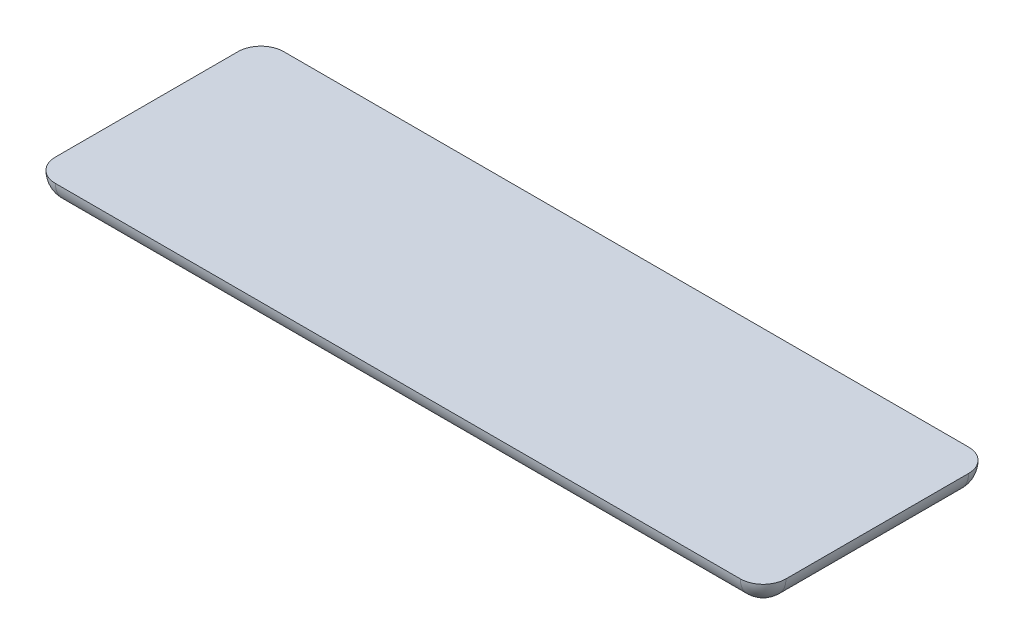
ISO-10303-21;
HEADER;
FILE_DESCRIPTION(('STEP AP214'),'2;1');
FILE_NAME('part.step','',(''),(''),'','','');
FILE_SCHEMA(('AUTOMOTIVE_DESIGN { 1 0 10303 214 1 1 1 1 }'));
ENDSEC;
DATA;
#1=APPLICATION_CONTEXT('core data for automotive mechanical design processes');
#2=APPLICATION_PROTOCOL_DEFINITION('international standard','automotive_design',2000,#1);
#3=PRODUCT_CONTEXT('',#1,'mechanical');
#4=PRODUCT('Part','Part','',(#3));
#5=PRODUCT_RELATED_PRODUCT_CATEGORY('part','',(#4));
#6=PRODUCT_DEFINITION_FORMATION('','',#4);
#7=PRODUCT_DEFINITION_CONTEXT('part definition',#1,'design');
#8=PRODUCT_DEFINITION('design','',#6,#7);
#9=PRODUCT_DEFINITION_SHAPE('','',#8);
#10=(LENGTH_UNIT() NAMED_UNIT(*) SI_UNIT(.MILLI.,.METRE.));
#11=(NAMED_UNIT(*) PLANE_ANGLE_UNIT() SI_UNIT($,.RADIAN.));
#12=(NAMED_UNIT(*) SI_UNIT($,.STERADIAN.) SOLID_ANGLE_UNIT());
#13=UNCERTAINTY_MEASURE_WITH_UNIT(LENGTH_MEASURE(1.E-05),#10,'distance_accuracy_value','');
#14=(GEOMETRIC_REPRESENTATION_CONTEXT(3) GLOBAL_UNCERTAINTY_ASSIGNED_CONTEXT((#13)) GLOBAL_UNIT_ASSIGNED_CONTEXT((#10,
#11,#12)) REPRESENTATION_CONTEXT('',''));
#15=CARTESIAN_POINT('',(0.,0.,0.));
#16=DIRECTION('',(0.,0.,1.));
#17=DIRECTION('',(1.,0.,0.));
#18=AXIS2_PLACEMENT_3D('',#15,#16,#17);
#19=CARTESIAN_POINT('',(0.,-20.,0.));
#20=DIRECTION('',(0.,-1.,0.));
#21=DIRECTION('',(0.,0.,-1.));
#22=AXIS2_PLACEMENT_3D('',#19,#20,#21);
#23=PLANE('',#22);
#24=CARTESIAN_POINT('',(75.,-20.,20.));
#25=DIRECTION('',(0.,-1.,0.));
#26=DIRECTION('',(0.,0.,-1.));
#27=AXIS2_PLACEMENT_3D('',#24,#25,#26);
#28=CIRCLE('',#27,5.);
#29=CARTESIAN_POINT('',(80.,-20.,20.));
#30=VERTEX_POINT('',#29);
#31=CARTESIAN_POINT('',(75.,-20.,25.));
#32=VERTEX_POINT('',#31);
#33=EDGE_CURVE('E353',#30,#32,#28,.T.);
#34=ORIENTED_EDGE('',*,*,#33,.F.);
#35=DIRECTION('',(0.,0.,-1.));
#36=VECTOR('',#35,1.);
#37=CARTESIAN_POINT('',(80.,-20.,25.));
#38=LINE('',#37,#36);
#39=CARTESIAN_POINT('',(80.,-20.,-20.));
#40=VERTEX_POINT('',#39);
#41=EDGE_CURVE('E11',#30,#40,#38,.T.);
#42=ORIENTED_EDGE('',*,*,#41,.T.);
#43=CARTESIAN_POINT('',(75.,-20.,-20.));
#44=DIRECTION('',(0.,-1.,0.));
#45=DIRECTION('',(0.,0.,-1.));
#46=AXIS2_PLACEMENT_3D('',#43,#44,#45);
#47=CIRCLE('',#46,5.);
#48=CARTESIAN_POINT('',(75.,-20.,-25.));
#49=VERTEX_POINT('',#48);
#50=EDGE_CURVE('E351',#49,#40,#47,.T.);
#51=ORIENTED_EDGE('',*,*,#50,.F.);
#52=DIRECTION('',(-1.,0.,0.));
#53=VECTOR('',#52,1.);
#54=CARTESIAN_POINT('',(80.,-20.,-25.));
#55=LINE('',#54,#53);
#56=CARTESIAN_POINT('',(-75.,-20.,-25.));
#57=VERTEX_POINT('',#56);
#58=EDGE_CURVE('E339',#49,#57,#55,.T.);
#59=ORIENTED_EDGE('',*,*,#58,.T.);
#60=CARTESIAN_POINT('',(-75.,-20.,-20.));
#61=DIRECTION('',(0.,-1.,0.));
#62=DIRECTION('',(0.,0.,-1.));
#63=AXIS2_PLACEMENT_3D('',#60,#61,#62);
#64=CIRCLE('',#63,5.);
#65=CARTESIAN_POINT('',(-80.,-20.,-20.));
#66=VERTEX_POINT('',#65);
#67=EDGE_CURVE('E366',#66,#57,#64,.T.);
#68=ORIENTED_EDGE('',*,*,#67,.F.);
#69=DIRECTION('',(0.,0.,1.));
#70=VECTOR('',#69,1.);
#71=CARTESIAN_POINT('',(-80.,-20.,25.));
#72=LINE('',#71,#70);
#73=CARTESIAN_POINT('',(-80.,-20.,20.));
#74=VERTEX_POINT('',#73);
#75=EDGE_CURVE('E44',#66,#74,#72,.T.);
#76=ORIENTED_EDGE('',*,*,#75,.T.);
#77=CARTESIAN_POINT('',(-75.,-20.,20.));
#78=DIRECTION('',(0.,-1.,0.));
#79=DIRECTION('',(0.,0.,-1.));
#80=AXIS2_PLACEMENT_3D('',#77,#78,#79);
#81=CIRCLE('',#80,5.);
#82=CARTESIAN_POINT('',(-75.,-20.,25.));
#83=VERTEX_POINT('',#82);
#84=EDGE_CURVE('E367',#83,#74,#81,.T.);
#85=ORIENTED_EDGE('',*,*,#84,.F.);
#86=DIRECTION('',(1.,0.,0.));
#87=VECTOR('',#86,1.);
#88=CARTESIAN_POINT('',(80.,-20.,25.));
#89=LINE('',#88,#87);
#90=EDGE_CURVE('E52',#83,#32,#89,.T.);
#91=ORIENTED_EDGE('',*,*,#90,.T.);
#92=EDGE_LOOP('',(#34,#42,#51,#59,#68,#76,#85,#91));
#93=FACE_BOUND('',#92,.T.);
#94=ADVANCED_FACE('F36',(#93),#23,.F.);
#95=CARTESIAN_POINT('',(39.5,-31.,-6.5));
#96=DIRECTION('',(-1.,0.,0.));
#97=DIRECTION('',(0.,0.,1.));
#98=AXIS2_PLACEMENT_3D('',#95,#96,#97);
#99=PLANE('',#98);
#100=DIRECTION('',(0.,0.,-1.));
#101=VECTOR('',#100,1.);
#102=CARTESIAN_POINT('',(39.5,-28.,-6.5));
#103=LINE('',#102,#101);
#104=CARTESIAN_POINT('',(39.5,-28.,6.5));
#105=VERTEX_POINT('',#104);
#106=CARTESIAN_POINT('',(39.5,-28.,4.5));
#107=VERTEX_POINT('',#106);
#108=EDGE_CURVE('E506',#105,#107,#103,.T.);
#109=ORIENTED_EDGE('',*,*,#108,.T.);
#110=DIRECTION('',(0.,1.,0.));
#111=VECTOR('',#110,1.);
#112=CARTESIAN_POINT('',(39.5,-31.,4.5));
#113=LINE('',#112,#111);
#114=CARTESIAN_POINT('',(39.5,-25.,4.5));
#115=VERTEX_POINT('',#114);
#116=EDGE_CURVE('E230',#107,#115,#113,.T.);
#117=ORIENTED_EDGE('',*,*,#116,.T.);
#118=DIRECTION('',(0.,0.,1.));
#119=VECTOR('',#118,1.);
#120=CARTESIAN_POINT('',(39.5,-25.,-6.5));
#121=LINE('',#120,#119);
#122=CARTESIAN_POINT('',(39.5,-25.,-4.50000000000001));
#123=VERTEX_POINT('',#122);
#124=EDGE_CURVE('E225',#123,#115,#121,.T.);
#125=ORIENTED_EDGE('',*,*,#124,.F.);
#126=DIRECTION('',(0.,-1.,0.));
#127=VECTOR('',#126,1.);
#128=CARTESIAN_POINT('',(39.5,-31.,-4.5));
#129=LINE('',#128,#127);
#130=CARTESIAN_POINT('',(39.5,-28.,-4.5));
#131=VERTEX_POINT('',#130);
#132=EDGE_CURVE('E205',#123,#131,#129,.T.);
#133=ORIENTED_EDGE('',*,*,#132,.T.);
#134=DIRECTION('',(0.,0.,-1.));
#135=VECTOR('',#134,1.);
#136=CARTESIAN_POINT('',(39.5,-28.,-6.5));
#137=LINE('',#136,#135);
#138=CARTESIAN_POINT('',(39.5,-28.,-6.50000000000001));
#139=VERTEX_POINT('',#138);
#140=EDGE_CURVE('E493',#131,#139,#137,.T.);
#141=ORIENTED_EDGE('',*,*,#140,.T.);
#142=DIRECTION('',(0.,1.,0.));
#143=VECTOR('',#142,1.);
#144=CARTESIAN_POINT('',(39.5,-31.,-6.5));
#145=LINE('',#144,#143);
#146=CARTESIAN_POINT('',(39.5,-31.,-6.5));
#147=VERTEX_POINT('',#146);
#148=EDGE_CURVE('E242',#147,#139,#145,.T.);
#149=ORIENTED_EDGE('',*,*,#148,.F.);
#150=DIRECTION('',(0.,0.,1.));
#151=VECTOR('',#150,1.);
#152=CARTESIAN_POINT('',(39.5,-31.,-6.5));
#153=LINE('',#152,#151);
#154=CARTESIAN_POINT('',(39.5,-31.,6.5));
#155=VERTEX_POINT('',#154);
#156=EDGE_CURVE('E224',#147,#155,#153,.T.);
#157=ORIENTED_EDGE('',*,*,#156,.T.);
#158=DIRECTION('',(0.,1.,0.));
#159=VECTOR('',#158,1.);
#160=CARTESIAN_POINT('',(39.5,-31.,6.5));
#161=LINE('',#160,#159);
#162=EDGE_CURVE('E234',#155,#105,#161,.T.);
#163=ORIENTED_EDGE('',*,*,#162,.T.);
#164=EDGE_LOOP('',(#109,#117,#125,#133,#141,#149,#157,#163));
#165=FACE_BOUND('',#164,.T.);
#166=ADVANCED_FACE('F402',(#165),#99,.T.);
#167=CARTESIAN_POINT('',(65.5,-31.,-6.5));
#168=DIRECTION('',(0.,0.,-1.));
#169=DIRECTION('',(-1.,0.,0.));
#170=AXIS2_PLACEMENT_3D('',#167,#168,#169);
#171=PLANE('',#170);
#172=DIRECTION('',(0.,1.,0.));
#173=VECTOR('',#172,1.);
#174=CARTESIAN_POINT('',(65.5,-31.,-6.5));
#175=LINE('',#174,#173);
#176=CARTESIAN_POINT('',(65.5,-29.,-6.5));
#177=VERTEX_POINT('',#176);
#178=CARTESIAN_POINT('',(65.5,-28.,-6.50000000000001));
#179=VERTEX_POINT('',#178);
#180=EDGE_CURVE('E240',#177,#179,#175,.T.);
#181=ORIENTED_EDGE('',*,*,#180,.F.);
#182=CARTESIAN_POINT('',(63.5,-29.,-6.5));
#183=DIRECTION('',(0.,0.,-1.));
#184=DIRECTION('',(-1.,0.,0.));
#185=AXIS2_PLACEMENT_3D('',#182,#183,#184);
#186=CIRCLE('',#185,2.);
#187=CARTESIAN_POINT('',(63.5,-31.,-6.5));
#188=VERTEX_POINT('',#187);
#189=EDGE_CURVE('E322',#177,#188,#186,.T.);
#190=ORIENTED_EDGE('',*,*,#189,.T.);
#191=DIRECTION('',(-1.,0.,0.));
#192=VECTOR('',#191,1.);
#193=CARTESIAN_POINT('',(65.5,-31.,-6.5));
#194=LINE('',#193,#192);
#195=EDGE_CURVE('E228',#188,#147,#194,.T.);
#196=ORIENTED_EDGE('',*,*,#195,.T.);
#197=ORIENTED_EDGE('',*,*,#148,.T.);
#198=DIRECTION('',(1.,0.,0.));
#199=VECTOR('',#198,1.);
#200=CARTESIAN_POINT('',(-80.,-28.,-6.50000000000001));
#201=LINE('',#200,#199);
#202=EDGE_CURVE('E494',#139,#179,#201,.T.);
#203=ORIENTED_EDGE('',*,*,#202,.T.);
#204=EDGE_LOOP('',(#181,#190,#196,#197,#203));
#205=FACE_BOUND('',#204,.T.);
#206=ADVANCED_FACE('F407',(#205),#171,.T.);
#207=CARTESIAN_POINT('',(65.5,-31.,-6.5));
#208=DIRECTION('',(1.,0.,0.));
#209=DIRECTION('',(0.,0.,-1.));
#210=AXIS2_PLACEMENT_3D('',#207,#208,#209);
#211=PLANE('',#210);
#212=DIRECTION('',(0.,1.,0.));
#213=VECTOR('',#212,1.);
#214=CARTESIAN_POINT('',(65.5,-31.,6.5));
#215=LINE('',#214,#213);
#216=CARTESIAN_POINT('',(65.5,-29.,6.5));
#217=VERTEX_POINT('',#216);
#218=CARTESIAN_POINT('',(65.5,-28.,6.50000000000001));
#219=VERTEX_POINT('',#218);
#220=EDGE_CURVE('E237',#217,#219,#215,.T.);
#221=ORIENTED_EDGE('',*,*,#220,.F.);
#222=DIRECTION('',(0.,0.,-1.));
#223=VECTOR('',#222,1.);
#224=CARTESIAN_POINT('',(65.5,-29.,-6.5));
#225=LINE('',#224,#223);
#226=EDGE_CURVE('E319',#217,#177,#225,.T.);
#227=ORIENTED_EDGE('',*,*,#226,.T.);
#228=ORIENTED_EDGE('',*,*,#180,.T.);
#229=DIRECTION('',(0.,0.,1.));
#230=VECTOR('',#229,1.);
#231=CARTESIAN_POINT('',(65.5,-28.,-6.50000000000001));
#232=LINE('',#231,#230);
#233=CARTESIAN_POINT('',(65.5,-28.,-4.5));
#234=VERTEX_POINT('',#233);
#235=EDGE_CURVE('E211',#179,#234,#232,.T.);
#236=ORIENTED_EDGE('',*,*,#235,.T.);
#237=DIRECTION('',(0.,1.,0.));
#238=VECTOR('',#237,1.);
#239=CARTESIAN_POINT('',(65.5,-25.,-4.50000000000001));
#240=LINE('',#239,#238);
#241=CARTESIAN_POINT('',(65.5,-25.,-4.50000000000001));
#242=VERTEX_POINT('',#241);
#243=EDGE_CURVE('E202',#234,#242,#240,.T.);
#244=ORIENTED_EDGE('',*,*,#243,.T.);
#245=DIRECTION('',(0.,0.,-1.));
#246=VECTOR('',#245,1.);
#247=CARTESIAN_POINT('',(65.5,-25.,-6.5));
#248=LINE('',#247,#246);
#249=CARTESIAN_POINT('',(65.5,-25.,4.5));
#250=VERTEX_POINT('',#249);
#251=EDGE_CURVE('E218',#250,#242,#248,.T.);
#252=ORIENTED_EDGE('',*,*,#251,.F.);
#253=DIRECTION('',(0.,-1.,0.));
#254=VECTOR('',#253,1.);
#255=CARTESIAN_POINT('',(65.5,-25.,4.5));
#256=LINE('',#255,#254);
#257=CARTESIAN_POINT('',(65.5,-28.,4.5));
#258=VERTEX_POINT('',#257);
#259=EDGE_CURVE('E502',#250,#258,#256,.T.);
#260=ORIENTED_EDGE('',*,*,#259,.T.);
#261=DIRECTION('',(0.,0.,1.));
#262=VECTOR('',#261,1.);
#263=CARTESIAN_POINT('',(65.5,-28.,6.50000000000001));
#264=LINE('',#263,#262);
#265=EDGE_CURVE('E496',#258,#219,#264,.T.);
#266=ORIENTED_EDGE('',*,*,#265,.T.);
#267=EDGE_LOOP('',(#221,#227,#228,#236,#244,#252,#260,#266));
#268=FACE_BOUND('',#267,.T.);
#269=ADVANCED_FACE('F216',(#268),#211,.T.);
#270=CARTESIAN_POINT('',(65.5,-31.,6.5));
#271=DIRECTION('',(0.,0.,1.));
#272=DIRECTION('',(1.,0.,0.));
#273=AXIS2_PLACEMENT_3D('',#270,#271,#272);
#274=PLANE('',#273);
#275=DIRECTION('',(1.,0.,0.));
#276=VECTOR('',#275,1.);
#277=CARTESIAN_POINT('',(65.5,-31.,6.5));
#278=LINE('',#277,#276);
#279=CARTESIAN_POINT('',(63.5,-31.,6.5));
#280=VERTEX_POINT('',#279);
#281=EDGE_CURVE('E238',#155,#280,#278,.T.);
#282=ORIENTED_EDGE('',*,*,#281,.T.);
#283=CARTESIAN_POINT('',(63.5,-29.,6.5));
#284=DIRECTION('',(0.,0.,1.));
#285=DIRECTION('',(1.,0.,0.));
#286=AXIS2_PLACEMENT_3D('',#283,#284,#285);
#287=CIRCLE('',#286,2.);
#288=EDGE_CURVE('E326',#280,#217,#287,.T.);
#289=ORIENTED_EDGE('',*,*,#288,.T.);
#290=ORIENTED_EDGE('',*,*,#220,.T.);
#291=DIRECTION('',(-1.,0.,0.));
#292=VECTOR('',#291,1.);
#293=CARTESIAN_POINT('',(65.5,-28.,6.5));
#294=LINE('',#293,#292);
#295=EDGE_CURVE('E316',#219,#105,#294,.T.);
#296=ORIENTED_EDGE('',*,*,#295,.T.);
#297=ORIENTED_EDGE('',*,*,#162,.F.);
#298=EDGE_LOOP('',(#282,#289,#290,#296,#297));
#299=FACE_BOUND('',#298,.T.);
#300=ADVANCED_FACE('F429',(#299),#274,.T.);
#301=CARTESIAN_POINT('',(0.,-25.,0.));
#302=DIRECTION('',(0.,1.,0.));
#303=DIRECTION('',(0.,0.,1.));
#304=AXIS2_PLACEMENT_3D('',#301,#302,#303);
#305=PLANE('',#304);
#306=DIRECTION('',(0.,0.,1.));
#307=VECTOR('',#306,1.);
#308=CARTESIAN_POINT('',(-75.,-25.,0.));
#309=LINE('',#308,#307);
#310=CARTESIAN_POINT('',(-75.,-25.,20.));
#311=VERTEX_POINT('',#310);
#312=CARTESIAN_POINT('',(-75.,-25.,-20.));
#313=VERTEX_POINT('',#312);
#314=EDGE_CURVE('E330',#311,#313,#309,.F.);
#315=ORIENTED_EDGE('',*,*,#314,.T.);
#316=DIRECTION('',(-1.,0.,0.));
#317=VECTOR('',#316,1.);
#318=CARTESIAN_POINT('',(0.,-25.,-20.));
#319=LINE('',#318,#317);
#320=CARTESIAN_POINT('',(75.,-25.,-20.));
#321=VERTEX_POINT('',#320);
#322=EDGE_CURVE('E335',#313,#321,#319,.F.);
#323=ORIENTED_EDGE('',*,*,#322,.T.);
#324=DIRECTION('',(0.,0.,-1.));
#325=VECTOR('',#324,1.);
#326=CARTESIAN_POINT('',(75.,-25.,0.));
#327=LINE('',#326,#325);
#328=CARTESIAN_POINT('',(75.,-25.,20.));
#329=VERTEX_POINT('',#328);
#330=EDGE_CURVE('E332',#321,#329,#327,.F.);
#331=ORIENTED_EDGE('',*,*,#330,.T.);
#332=DIRECTION('',(1.,0.,0.));
#333=VECTOR('',#332,1.);
#334=CARTESIAN_POINT('',(0.,-25.,20.));
#335=LINE('',#334,#333);
#336=EDGE_CURVE('E327',#329,#311,#335,.F.);
#337=ORIENTED_EDGE('',*,*,#336,.T.);
#338=EDGE_LOOP('',(#315,#323,#331,#337));
#339=FACE_BOUND('',#338,.T.);
#340=DIRECTION('',(0.,0.,-1.));
#341=VECTOR('',#340,1.);
#342=CARTESIAN_POINT('',(-65.5,-25.,-6.5));
#343=LINE('',#342,#341);
#344=CARTESIAN_POINT('',(-65.5,-25.,4.5));
#345=VERTEX_POINT('',#344);
#346=CARTESIAN_POINT('',(-65.5,-25.,-4.50000000000001));
#347=VERTEX_POINT('',#346);
#348=EDGE_CURVE('E285',#345,#347,#343,.T.);
#349=ORIENTED_EDGE('',*,*,#348,.F.);
#350=DIRECTION('',(-1.,0.,0.));
#351=VECTOR('',#350,1.);
#352=CARTESIAN_POINT('',(80.,-25.,4.5));
#353=LINE('',#352,#351);
#354=CARTESIAN_POINT('',(-39.5,-25.,4.5));
#355=VERTEX_POINT('',#354);
#356=EDGE_CURVE('E261',#355,#345,#353,.T.);
#357=ORIENTED_EDGE('',*,*,#356,.F.);
#358=DIRECTION('',(0.,0.,1.));
#359=VECTOR('',#358,1.);
#360=CARTESIAN_POINT('',(-39.5,-25.,-6.5));
#361=LINE('',#360,#359);
#362=CARTESIAN_POINT('',(-39.5,-25.,-4.50000000000001));
#363=VERTEX_POINT('',#362);
#364=EDGE_CURVE('E280',#363,#355,#361,.T.);
#365=ORIENTED_EDGE('',*,*,#364,.F.);
#366=DIRECTION('',(-1.,0.,0.));
#367=VECTOR('',#366,1.);
#368=CARTESIAN_POINT('',(80.,-25.,-4.50000000000001));
#369=LINE('',#368,#367);
#370=EDGE_CURVE('E252',#363,#347,#369,.T.);
#371=ORIENTED_EDGE('',*,*,#370,.T.);
#372=EDGE_LOOP('',(#349,#357,#365,#371));
#373=FACE_BOUND('',#372,.T.);
#374=ORIENTED_EDGE('',*,*,#124,.T.);
#375=DIRECTION('',(1.,0.,0.));
#376=VECTOR('',#375,1.);
#377=CARTESIAN_POINT('',(-80.,-25.,4.5));
#378=LINE('',#377,#376);
#379=EDGE_CURVE('E222',#115,#250,#378,.T.);
#380=ORIENTED_EDGE('',*,*,#379,.T.);
#381=ORIENTED_EDGE('',*,*,#251,.T.);
#382=DIRECTION('',(1.,0.,0.));
#383=VECTOR('',#382,1.);
#384=CARTESIAN_POINT('',(-80.,-25.,-4.50000000000001));
#385=LINE('',#384,#383);
#386=EDGE_CURVE('E198',#123,#242,#385,.T.);
#387=ORIENTED_EDGE('',*,*,#386,.F.);
#388=EDGE_LOOP('',(#374,#380,#381,#387));
#389=FACE_BOUND('',#388,.T.);
#390=ADVANCED_FACE('F221',(#339,#373,#389),#305,.F.);
#391=CARTESIAN_POINT('',(-39.5,-31.,-6.5));
#392=DIRECTION('',(-1.,0.,0.));
#393=DIRECTION('',(0.,0.,1.));
#394=AXIS2_PLACEMENT_3D('',#391,#392,#393);
#395=PLANE('',#394);
#396=DIRECTION('',(0.,0.,1.));
#397=VECTOR('',#396,1.);
#398=CARTESIAN_POINT('',(-39.5,-28.,-6.5));
#399=LINE('',#398,#397);
#400=CARTESIAN_POINT('',(-39.5,-28.,-6.5));
#401=VERTEX_POINT('',#400);
#402=CARTESIAN_POINT('',(-39.5,-28.,-4.5));
#403=VERTEX_POINT('',#402);
#404=EDGE_CURVE('E265',#401,#403,#399,.T.);
#405=ORIENTED_EDGE('',*,*,#404,.T.);
#406=DIRECTION('',(0.,1.,0.));
#407=VECTOR('',#406,1.);
#408=CARTESIAN_POINT('',(-39.5,-31.,-4.5));
#409=LINE('',#408,#407);
#410=EDGE_CURVE('E277',#403,#363,#409,.T.);
#411=ORIENTED_EDGE('',*,*,#410,.T.);
#412=ORIENTED_EDGE('',*,*,#364,.T.);
#413=DIRECTION('',(0.,-1.,0.));
#414=VECTOR('',#413,1.);
#415=CARTESIAN_POINT('',(-39.5,-31.,4.5));
#416=LINE('',#415,#414);
#417=CARTESIAN_POINT('',(-39.5,-28.,4.5));
#418=VERTEX_POINT('',#417);
#419=EDGE_CURVE('E271',#355,#418,#416,.T.);
#420=ORIENTED_EDGE('',*,*,#419,.T.);
#421=DIRECTION('',(0.,0.,1.));
#422=VECTOR('',#421,1.);
#423=CARTESIAN_POINT('',(-39.5,-28.,-6.5));
#424=LINE('',#423,#422);
#425=CARTESIAN_POINT('',(-39.5,-28.,6.50000000000001));
#426=VERTEX_POINT('',#425);
#427=EDGE_CURVE('E274',#418,#426,#424,.T.);
#428=ORIENTED_EDGE('',*,*,#427,.T.);
#429=DIRECTION('',(0.,1.,0.));
#430=VECTOR('',#429,1.);
#431=CARTESIAN_POINT('',(-39.5,-31.,6.5));
#432=LINE('',#431,#430);
#433=CARTESIAN_POINT('',(-39.5,-31.,6.5));
#434=VERTEX_POINT('',#433);
#435=EDGE_CURVE('E301',#434,#426,#432,.T.);
#436=ORIENTED_EDGE('',*,*,#435,.F.);
#437=DIRECTION('',(0.,0.,1.));
#438=VECTOR('',#437,1.);
#439=CARTESIAN_POINT('',(-39.5,-31.,-6.5));
#440=LINE('',#439,#438);
#441=CARTESIAN_POINT('',(-39.5,-31.,-6.5));
#442=VERTEX_POINT('',#441);
#443=EDGE_CURVE('E281',#442,#434,#440,.T.);
#444=ORIENTED_EDGE('',*,*,#443,.F.);
#445=DIRECTION('',(0.,1.,0.));
#446=VECTOR('',#445,1.);
#447=CARTESIAN_POINT('',(-39.5,-31.,-6.5));
#448=LINE('',#447,#446);
#449=EDGE_CURVE('E290',#442,#401,#448,.T.);
#450=ORIENTED_EDGE('',*,*,#449,.T.);
#451=EDGE_LOOP('',(#405,#411,#412,#420,#428,#436,#444,#450));
#452=FACE_BOUND('',#451,.T.);
#453=ADVANCED_FACE('F428',(#452),#395,.F.);
#454=CARTESIAN_POINT('',(-65.5,-31.,6.5));
#455=DIRECTION('',(0.,0.,-1.));
#456=DIRECTION('',(-1.,0.,0.));
#457=AXIS2_PLACEMENT_3D('',#454,#455,#456);
#458=PLANE('',#457);
#459=DIRECTION('',(0.,1.,0.));
#460=VECTOR('',#459,1.);
#461=CARTESIAN_POINT('',(-65.5,-31.,6.5));
#462=LINE('',#461,#460);
#463=CARTESIAN_POINT('',(-65.5,-29.,6.5));
#464=VERTEX_POINT('',#463);
#465=CARTESIAN_POINT('',(-65.5,-28.,6.50000000000001));
#466=VERTEX_POINT('',#465);
#467=EDGE_CURVE('E299',#464,#466,#462,.T.);
#468=ORIENTED_EDGE('',*,*,#467,.F.);
#469=CARTESIAN_POINT('',(-63.5,-29.,6.5));
#470=DIRECTION('',(0.,0.,-1.));
#471=DIRECTION('',(-1.,0.,0.));
#472=AXIS2_PLACEMENT_3D('',#469,#470,#471);
#473=CIRCLE('',#472,2.);
#474=CARTESIAN_POINT('',(-63.5,-31.,6.5));
#475=VERTEX_POINT('',#474);
#476=EDGE_CURVE('E314',#464,#475,#473,.F.);
#477=ORIENTED_EDGE('',*,*,#476,.T.);
#478=DIRECTION('',(-1.,0.,0.));
#479=VECTOR('',#478,1.);
#480=CARTESIAN_POINT('',(-65.5,-31.,6.5));
#481=LINE('',#480,#479);
#482=EDGE_CURVE('E284',#434,#475,#481,.T.);
#483=ORIENTED_EDGE('',*,*,#482,.F.);
#484=ORIENTED_EDGE('',*,*,#435,.T.);
#485=DIRECTION('',(-1.,0.,0.));
#486=VECTOR('',#485,1.);
#487=CARTESIAN_POINT('',(80.,-28.,6.50000000000001));
#488=LINE('',#487,#486);
#489=EDGE_CURVE('E262',#426,#466,#488,.T.);
#490=ORIENTED_EDGE('',*,*,#489,.T.);
#491=EDGE_LOOP('',(#468,#477,#483,#484,#490));
#492=FACE_BOUND('',#491,.T.);
#493=ADVANCED_FACE('F432',(#492),#458,.F.);
#494=CARTESIAN_POINT('',(-65.5,-31.,-6.5));
#495=DIRECTION('',(1.,0.,0.));
#496=DIRECTION('',(0.,0.,-1.));
#497=AXIS2_PLACEMENT_3D('',#494,#495,#496);
#498=PLANE('',#497);
#499=DIRECTION('',(0.,1.,0.));
#500=VECTOR('',#499,1.);
#501=CARTESIAN_POINT('',(-65.5,-31.,-6.5));
#502=LINE('',#501,#500);
#503=CARTESIAN_POINT('',(-65.5,-29.,-6.5));
#504=VERTEX_POINT('',#503);
#505=CARTESIAN_POINT('',(-65.5,-28.,-6.50000000000001));
#506=VERTEX_POINT('',#505);
#507=EDGE_CURVE('E297',#504,#506,#502,.T.);
#508=ORIENTED_EDGE('',*,*,#507,.F.);
#509=DIRECTION('',(0.,0.,-1.));
#510=VECTOR('',#509,1.);
#511=CARTESIAN_POINT('',(-65.5,-29.,-6.5));
#512=LINE('',#511,#510);
#513=EDGE_CURVE('E312',#504,#464,#512,.F.);
#514=ORIENTED_EDGE('',*,*,#513,.T.);
#515=ORIENTED_EDGE('',*,*,#467,.T.);
#516=DIRECTION('',(0.,0.,1.));
#517=VECTOR('',#516,1.);
#518=CARTESIAN_POINT('',(-65.5,-28.,6.50000000000001));
#519=LINE('',#518,#517);
#520=CARTESIAN_POINT('',(-65.5,-28.,4.5));
#521=VERTEX_POINT('',#520);
#522=EDGE_CURVE('E258',#521,#466,#519,.T.);
#523=ORIENTED_EDGE('',*,*,#522,.F.);
#524=DIRECTION('',(0.,-1.,0.));
#525=VECTOR('',#524,1.);
#526=CARTESIAN_POINT('',(-65.5,-25.,4.5));
#527=LINE('',#526,#525);
#528=EDGE_CURVE('E254',#345,#521,#527,.T.);
#529=ORIENTED_EDGE('',*,*,#528,.F.);
#530=ORIENTED_EDGE('',*,*,#348,.T.);
#531=DIRECTION('',(0.,1.,0.));
#532=VECTOR('',#531,1.);
#533=CARTESIAN_POINT('',(-65.5,-25.,-4.50000000000001));
#534=LINE('',#533,#532);
#535=CARTESIAN_POINT('',(-65.5,-28.,-4.5));
#536=VERTEX_POINT('',#535);
#537=EDGE_CURVE('E248',#536,#347,#534,.T.);
#538=ORIENTED_EDGE('',*,*,#537,.F.);
#539=DIRECTION('',(0.,0.,1.));
#540=VECTOR('',#539,1.);
#541=CARTESIAN_POINT('',(-65.5,-28.,-6.50000000000001));
#542=LINE('',#541,#540);
#543=EDGE_CURVE('E245',#506,#536,#542,.T.);
#544=ORIENTED_EDGE('',*,*,#543,.F.);
#545=EDGE_LOOP('',(#508,#514,#515,#523,#529,#530,#538,#544));
#546=FACE_BOUND('',#545,.T.);
#547=ADVANCED_FACE('F436',(#546),#498,.F.);
#548=CARTESIAN_POINT('',(-65.5,-31.,-6.5));
#549=DIRECTION('',(0.,0.,1.));
#550=DIRECTION('',(1.,0.,0.));
#551=AXIS2_PLACEMENT_3D('',#548,#549,#550);
#552=PLANE('',#551);
#553=DIRECTION('',(1.,0.,0.));
#554=VECTOR('',#553,1.);
#555=CARTESIAN_POINT('',(-65.5,-31.,-6.5));
#556=LINE('',#555,#554);
#557=CARTESIAN_POINT('',(-63.5,-31.,-6.5));
#558=VERTEX_POINT('',#557);
#559=EDGE_CURVE('E288',#558,#442,#556,.T.);
#560=ORIENTED_EDGE('',*,*,#559,.F.);
#561=CARTESIAN_POINT('',(-63.5,-29.,-6.5));
#562=DIRECTION('',(0.,0.,1.));
#563=DIRECTION('',(1.,0.,0.));
#564=AXIS2_PLACEMENT_3D('',#561,#562,#563);
#565=CIRCLE('',#564,2.);
#566=EDGE_CURVE('E310',#558,#504,#565,.F.);
#567=ORIENTED_EDGE('',*,*,#566,.T.);
#568=ORIENTED_EDGE('',*,*,#507,.T.);
#569=DIRECTION('',(1.,0.,0.));
#570=VECTOR('',#569,1.);
#571=CARTESIAN_POINT('',(-65.5,-28.,-6.5));
#572=LINE('',#571,#570);
#573=EDGE_CURVE('E304',#506,#401,#572,.T.);
#574=ORIENTED_EDGE('',*,*,#573,.T.);
#575=ORIENTED_EDGE('',*,*,#449,.F.);
#576=EDGE_LOOP('',(#560,#567,#568,#574,#575));
#577=FACE_BOUND('',#576,.T.);
#578=ADVANCED_FACE('F440',(#577),#552,.F.);
#579=CARTESIAN_POINT('',(0.,-31.,0.));
#580=DIRECTION('',(0.,1.,0.));
#581=DIRECTION('',(0.,0.,1.));
#582=AXIS2_PLACEMENT_3D('',#579,#580,#581);
#583=PLANE('',#582);
#584=ORIENTED_EDGE('',*,*,#482,.T.);
#585=DIRECTION('',(0.,0.,-1.));
#586=VECTOR('',#585,1.);
#587=CARTESIAN_POINT('',(-63.5,-31.,0.));
#588=LINE('',#587,#586);
#589=EDGE_CURVE('E307',#475,#558,#588,.T.);
#590=ORIENTED_EDGE('',*,*,#589,.T.);
#591=ORIENTED_EDGE('',*,*,#559,.T.);
#592=ORIENTED_EDGE('',*,*,#443,.T.);
#593=EDGE_LOOP('',(#584,#590,#591,#592));
#594=FACE_BOUND('',#593,.T.);
#595=ADVANCED_FACE('F444',(#594),#583,.F.);
#596=CARTESIAN_POINT('',(80.,-25.,-4.50000000000001));
#597=DIRECTION('',(0.,0.,1.));
#598=DIRECTION('',(0.,-1.,0.));
#599=AXIS2_PLACEMENT_3D('',#596,#597,#598);
#600=PLANE('',#599);
#601=DIRECTION('',(-1.,0.,0.));
#602=VECTOR('',#601,1.);
#603=CARTESIAN_POINT('',(80.,-28.,-4.5));
#604=LINE('',#603,#602);
#605=EDGE_CURVE('E251',#403,#536,#604,.T.);
#606=ORIENTED_EDGE('',*,*,#605,.T.);
#607=ORIENTED_EDGE('',*,*,#537,.T.);
#608=ORIENTED_EDGE('',*,*,#370,.F.);
#609=ORIENTED_EDGE('',*,*,#410,.F.);
#610=EDGE_LOOP('',(#606,#607,#608,#609));
#611=FACE_BOUND('',#610,.T.);
#612=ADVANCED_FACE('F448',(#611),#600,.F.);
#613=CARTESIAN_POINT('',(80.,-28.,-6.50000000000001));
#614=DIRECTION('',(0.,-1.,0.));
#615=DIRECTION('',(0.,0.,-1.));
#616=AXIS2_PLACEMENT_3D('',#613,#614,#615);
#617=PLANE('',#616);
#618=ORIENTED_EDGE('',*,*,#573,.F.);
#619=ORIENTED_EDGE('',*,*,#543,.T.);
#620=ORIENTED_EDGE('',*,*,#605,.F.);
#621=ORIENTED_EDGE('',*,*,#404,.F.);
#622=EDGE_LOOP('',(#618,#619,#620,#621));
#623=FACE_BOUND('',#622,.T.);
#624=ADVANCED_FACE('F456',(#623),#617,.F.);
#625=CARTESIAN_POINT('',(80.,-28.,6.50000000000001));
#626=DIRECTION('',(0.,-1.,0.));
#627=DIRECTION('',(0.,0.,-1.));
#628=AXIS2_PLACEMENT_3D('',#625,#626,#627);
#629=PLANE('',#628);
#630=DIRECTION('',(-1.,0.,0.));
#631=VECTOR('',#630,1.);
#632=CARTESIAN_POINT('',(80.,-28.,4.5));
#633=LINE('',#632,#631);
#634=EDGE_CURVE('E266',#418,#521,#633,.T.);
#635=ORIENTED_EDGE('',*,*,#634,.T.);
#636=ORIENTED_EDGE('',*,*,#522,.T.);
#637=ORIENTED_EDGE('',*,*,#489,.F.);
#638=ORIENTED_EDGE('',*,*,#427,.F.);
#639=EDGE_LOOP('',(#635,#636,#637,#638));
#640=FACE_BOUND('',#639,.T.);
#641=ADVANCED_FACE('F452',(#640),#629,.F.);
#642=CARTESIAN_POINT('',(80.,-25.,4.5));
#643=DIRECTION('',(0.,0.,-1.));
#644=DIRECTION('',(-1.,0.,0.));
#645=AXIS2_PLACEMENT_3D('',#642,#643,#644);
#646=PLANE('',#645);
#647=ORIENTED_EDGE('',*,*,#356,.T.);
#648=ORIENTED_EDGE('',*,*,#528,.T.);
#649=ORIENTED_EDGE('',*,*,#634,.F.);
#650=ORIENTED_EDGE('',*,*,#419,.F.);
#651=EDGE_LOOP('',(#647,#648,#649,#650));
#652=FACE_BOUND('',#651,.T.);
#653=ADVANCED_FACE('F424',(#652),#646,.F.);
#654=CARTESIAN_POINT('',(-63.5,-29.,0.));
#655=DIRECTION('',(0.,0.,-1.));
#656=DIRECTION('',(-1.,0.,0.));
#657=AXIS2_PLACEMENT_3D('',#654,#655,#656);
#658=CYLINDRICAL_SURFACE('',#657,2.);
#659=ORIENTED_EDGE('',*,*,#476,.F.);
#660=ORIENTED_EDGE('',*,*,#513,.F.);
#661=ORIENTED_EDGE('',*,*,#566,.F.);
#662=ORIENTED_EDGE('',*,*,#589,.F.);
#663=EDGE_LOOP('',(#659,#660,#661,#662));
#664=FACE_BOUND('',#663,.T.);
#665=ADVANCED_FACE('F420',(#664),#658,.T.);
#666=CARTESIAN_POINT('',(0.,-31.,0.));
#667=DIRECTION('',(0.,1.,0.));
#668=DIRECTION('',(0.,0.,1.));
#669=AXIS2_PLACEMENT_3D('',#666,#667,#668);
#670=PLANE('',#669);
#671=ORIENTED_EDGE('',*,*,#195,.F.);
#672=DIRECTION('',(0.,0.,-1.));
#673=VECTOR('',#672,1.);
#674=CARTESIAN_POINT('',(63.5,-31.,6.5));
#675=LINE('',#674,#673);
#676=EDGE_CURVE('E324',#188,#280,#675,.F.);
#677=ORIENTED_EDGE('',*,*,#676,.T.);
#678=ORIENTED_EDGE('',*,*,#281,.F.);
#679=ORIENTED_EDGE('',*,*,#156,.F.);
#680=EDGE_LOOP('',(#671,#677,#678,#679));
#681=FACE_BOUND('',#680,.T.);
#682=ADVANCED_FACE('F423',(#681),#670,.F.);
#683=CARTESIAN_POINT('',(-80.,-25.,4.5));
#684=DIRECTION('',(0.,0.,1.));
#685=DIRECTION('',(1.,0.,0.));
#686=AXIS2_PLACEMENT_3D('',#683,#684,#685);
#687=PLANE('',#686);
#688=DIRECTION('',(1.,0.,0.));
#689=VECTOR('',#688,1.);
#690=CARTESIAN_POINT('',(-80.,-28.,4.5));
#691=LINE('',#690,#689);
#692=EDGE_CURVE('E504',#107,#258,#691,.T.);
#693=ORIENTED_EDGE('',*,*,#692,.T.);
#694=ORIENTED_EDGE('',*,*,#259,.F.);
#695=ORIENTED_EDGE('',*,*,#379,.F.);
#696=ORIENTED_EDGE('',*,*,#116,.F.);
#697=EDGE_LOOP('',(#693,#694,#695,#696));
#698=FACE_BOUND('',#697,.T.);
#699=ADVANCED_FACE('F474',(#698),#687,.T.);
#700=CARTESIAN_POINT('',(-80.,-28.,6.50000000000001));
#701=DIRECTION('',(0.,1.,0.));
#702=DIRECTION('',(0.,0.,1.));
#703=AXIS2_PLACEMENT_3D('',#700,#701,#702);
#704=PLANE('',#703);
#705=ORIENTED_EDGE('',*,*,#295,.F.);
#706=ORIENTED_EDGE('',*,*,#265,.F.);
#707=ORIENTED_EDGE('',*,*,#692,.F.);
#708=ORIENTED_EDGE('',*,*,#108,.F.);
#709=EDGE_LOOP('',(#705,#706,#707,#708));
#710=FACE_BOUND('',#709,.T.);
#711=ADVANCED_FACE('F476',(#710),#704,.T.);
#712=CARTESIAN_POINT('',(-80.,-28.,-6.50000000000001));
#713=DIRECTION('',(0.,1.,0.));
#714=DIRECTION('',(0.,0.,1.));
#715=AXIS2_PLACEMENT_3D('',#712,#713,#714);
#716=PLANE('',#715);
#717=DIRECTION('',(1.,0.,0.));
#718=VECTOR('',#717,1.);
#719=CARTESIAN_POINT('',(-80.,-28.,-4.5));
#720=LINE('',#719,#718);
#721=EDGE_CURVE('E210',#131,#234,#720,.T.);
#722=ORIENTED_EDGE('',*,*,#721,.T.);
#723=ORIENTED_EDGE('',*,*,#235,.F.);
#724=ORIENTED_EDGE('',*,*,#202,.F.);
#725=ORIENTED_EDGE('',*,*,#140,.F.);
#726=EDGE_LOOP('',(#722,#723,#724,#725));
#727=FACE_BOUND('',#726,.T.);
#728=ADVANCED_FACE('F479',(#727),#716,.T.);
#729=CARTESIAN_POINT('',(-80.,-25.,-4.50000000000001));
#730=DIRECTION('',(0.,0.,-1.));
#731=DIRECTION('',(0.,1.,0.));
#732=AXIS2_PLACEMENT_3D('',#729,#730,#731);
#733=PLANE('',#732);
#734=ORIENTED_EDGE('',*,*,#386,.T.);
#735=ORIENTED_EDGE('',*,*,#243,.F.);
#736=ORIENTED_EDGE('',*,*,#721,.F.);
#737=ORIENTED_EDGE('',*,*,#132,.F.);
#738=EDGE_LOOP('',(#734,#735,#736,#737));
#739=FACE_BOUND('',#738,.T.);
#740=ADVANCED_FACE('F200',(#739),#733,.T.);
#741=CARTESIAN_POINT('',(63.5,-29.,-6.5));
#742=DIRECTION('',(0.,0.,1.));
#743=DIRECTION('',(1.,0.,0.));
#744=AXIS2_PLACEMENT_3D('',#741,#742,#743);
#745=CYLINDRICAL_SURFACE('',#744,2.);
#746=ORIENTED_EDGE('',*,*,#288,.F.);
#747=ORIENTED_EDGE('',*,*,#676,.F.);
#748=ORIENTED_EDGE('',*,*,#189,.F.);
#749=ORIENTED_EDGE('',*,*,#226,.F.);
#750=EDGE_LOOP('',(#746,#747,#748,#749));
#751=FACE_BOUND('',#750,.T.);
#752=ADVANCED_FACE('F415',(#751),#745,.T.);
#753=CARTESIAN_POINT('',(-75.,-20.,25.));
#754=DIRECTION('',(0.,0.,1.));
#755=DIRECTION('',(1.,0.,0.));
#756=AXIS2_PLACEMENT_3D('',#753,#754,#755);
#757=CYLINDRICAL_SURFACE('',#756,5.);
#758=CARTESIAN_POINT('',(-75.,-20.,20.));
#759=DIRECTION('',(0.,0.,1.));
#760=DIRECTION('',(1.,0.,0.));
#761=AXIS2_PLACEMENT_3D('',#758,#759,#760);
#762=CIRCLE('',#761,5.);
#763=EDGE_CURVE('E39',#74,#311,#762,.T.);
#764=ORIENTED_EDGE('',*,*,#763,.F.);
#765=ORIENTED_EDGE('',*,*,#75,.F.);
#766=CARTESIAN_POINT('',(-75.,-20.,-20.));
#767=DIRECTION('',(0.,0.,-1.));
#768=DIRECTION('',(-1.,0.,0.));
#769=AXIS2_PLACEMENT_3D('',#766,#767,#768);
#770=CIRCLE('',#769,5.);
#771=EDGE_CURVE('E363',#313,#66,#770,.T.);
#772=ORIENTED_EDGE('',*,*,#771,.F.);
#773=ORIENTED_EDGE('',*,*,#314,.F.);
#774=EDGE_LOOP('',(#764,#765,#772,#773));
#775=FACE_BOUND('',#774,.T.);
#776=ADVANCED_FACE('F418',(#775),#757,.T.);
#777=CARTESIAN_POINT('',(-75.,-20.,20.));
#778=DIRECTION('',(-1.,0.,0.));
#779=DIRECTION('',(0.,-1.,0.));
#780=AXIS2_PLACEMENT_3D('',#777,#778,#779);
#781=SPHERICAL_SURFACE('',#780,5.);
#782=ORIENTED_EDGE('',*,*,#84,.T.);
#783=ORIENTED_EDGE('',*,*,#763,.T.);
#784=CARTESIAN_POINT('',(-75.,-20.,20.));
#785=DIRECTION('',(-1.,0.,0.));
#786=DIRECTION('',(0.,0.,1.));
#787=AXIS2_PLACEMENT_3D('',#784,#785,#786);
#788=CIRCLE('',#787,5.);
#789=EDGE_CURVE('E361',#83,#311,#788,.F.);
#790=ORIENTED_EDGE('',*,*,#789,.F.);
#791=EDGE_LOOP('',(#782,#783,#790));
#792=FACE_BOUND('',#791,.T.);
#793=ADVANCED_FACE('F372',(#792),#781,.T.);
#794=CARTESIAN_POINT('',(-75.,-20.,-20.));
#795=DIRECTION('',(-1.,0.,0.));
#796=DIRECTION('',(0.,0.,1.));
#797=AXIS2_PLACEMENT_3D('',#794,#795,#796);
#798=SPHERICAL_SURFACE('',#797,5.);
#799=ORIENTED_EDGE('',*,*,#771,.T.);
#800=ORIENTED_EDGE('',*,*,#67,.T.);
#801=CARTESIAN_POINT('',(-75.,-20.,-20.));
#802=DIRECTION('',(-1.,0.,0.));
#803=DIRECTION('',(0.,0.,1.));
#804=AXIS2_PLACEMENT_3D('',#801,#802,#803);
#805=CIRCLE('',#804,5.);
#806=EDGE_CURVE('E358',#313,#57,#805,.F.);
#807=ORIENTED_EDGE('',*,*,#806,.F.);
#808=EDGE_LOOP('',(#799,#800,#807));
#809=FACE_BOUND('',#808,.T.);
#810=ADVANCED_FACE('F558',(#809),#798,.T.);
#811=CARTESIAN_POINT('',(80.,-20.,20.));
#812=DIRECTION('',(1.,0.,0.));
#813=DIRECTION('',(0.,0.,-1.));
#814=AXIS2_PLACEMENT_3D('',#811,#812,#813);
#815=CYLINDRICAL_SURFACE('',#814,5.);
#816=ORIENTED_EDGE('',*,*,#789,.T.);
#817=ORIENTED_EDGE('',*,*,#336,.F.);
#818=CARTESIAN_POINT('',(75.,-20.,20.));
#819=DIRECTION('',(1.,0.,0.));
#820=DIRECTION('',(0.,0.,-1.));
#821=AXIS2_PLACEMENT_3D('',#818,#819,#820);
#822=CIRCLE('',#821,5.);
#823=EDGE_CURVE('E355',#32,#329,#822,.T.);
#824=ORIENTED_EDGE('',*,*,#823,.F.);
#825=ORIENTED_EDGE('',*,*,#90,.F.);
#826=EDGE_LOOP('',(#816,#817,#824,#825));
#827=FACE_BOUND('',#826,.T.);
#828=ADVANCED_FACE('F376',(#827),#815,.T.);
#829=CARTESIAN_POINT('',(80.,-20.,-20.));
#830=DIRECTION('',(-1.,0.,0.));
#831=DIRECTION('',(0.,0.,1.));
#832=AXIS2_PLACEMENT_3D('',#829,#830,#831);
#833=CYLINDRICAL_SURFACE('',#832,5.);
#834=ORIENTED_EDGE('',*,*,#806,.T.);
#835=ORIENTED_EDGE('',*,*,#58,.F.);
#836=CARTESIAN_POINT('',(75.,-20.,-20.));
#837=DIRECTION('',(1.,0.,0.));
#838=DIRECTION('',(0.,0.,-1.));
#839=AXIS2_PLACEMENT_3D('',#836,#837,#838);
#840=CIRCLE('',#839,5.);
#841=EDGE_CURVE('E348',#321,#49,#840,.T.);
#842=ORIENTED_EDGE('',*,*,#841,.F.);
#843=ORIENTED_EDGE('',*,*,#322,.F.);
#844=EDGE_LOOP('',(#834,#835,#842,#843));
#845=FACE_BOUND('',#844,.T.);
#846=ADVANCED_FACE('F392',(#845),#833,.T.);
#847=CARTESIAN_POINT('',(75.,-20.,20.));
#848=DIRECTION('',(0.,0.,1.));
#849=DIRECTION('',(0.,-1.,0.));
#850=AXIS2_PLACEMENT_3D('',#847,#848,#849);
#851=SPHERICAL_SURFACE('',#850,5.);
#852=ORIENTED_EDGE('',*,*,#33,.T.);
#853=ORIENTED_EDGE('',*,*,#823,.T.);
#854=CARTESIAN_POINT('',(75.,-20.,20.));
#855=DIRECTION('',(0.,0.,1.));
#856=DIRECTION('',(1.,0.,0.));
#857=AXIS2_PLACEMENT_3D('',#854,#855,#856);
#858=CIRCLE('',#857,5.);
#859=EDGE_CURVE('E346',#30,#329,#858,.F.);
#860=ORIENTED_EDGE('',*,*,#859,.F.);
#861=EDGE_LOOP('',(#852,#853,#860));
#862=FACE_BOUND('',#861,.T.);
#863=ADVANCED_FACE('F390',(#862),#851,.T.);
#864=CARTESIAN_POINT('',(75.,-20.,-20.));
#865=DIRECTION('',(0.,0.,-1.));
#866=DIRECTION('',(0.,1.,0.));
#867=AXIS2_PLACEMENT_3D('',#864,#865,#866);
#868=SPHERICAL_SURFACE('',#867,5.);
#869=ORIENTED_EDGE('',*,*,#841,.T.);
#870=ORIENTED_EDGE('',*,*,#50,.T.);
#871=CARTESIAN_POINT('',(75.,-20.,-20.));
#872=DIRECTION('',(0.,0.,-1.));
#873=DIRECTION('',(-1.,0.,0.));
#874=AXIS2_PLACEMENT_3D('',#871,#872,#873);
#875=CIRCLE('',#874,5.);
#876=EDGE_CURVE('E343',#321,#40,#875,.F.);
#877=ORIENTED_EDGE('',*,*,#876,.F.);
#878=EDGE_LOOP('',(#869,#870,#877));
#879=FACE_BOUND('',#878,.T.);
#880=ADVANCED_FACE('F387',(#879),#868,.T.);
#881=CARTESIAN_POINT('',(75.,-20.,25.));
#882=DIRECTION('',(0.,0.,-1.));
#883=DIRECTION('',(-1.,0.,0.));
#884=AXIS2_PLACEMENT_3D('',#881,#882,#883);
#885=CYLINDRICAL_SURFACE('',#884,5.);
#886=ORIENTED_EDGE('',*,*,#859,.T.);
#887=ORIENTED_EDGE('',*,*,#330,.F.);
#888=ORIENTED_EDGE('',*,*,#876,.T.);
#889=ORIENTED_EDGE('',*,*,#41,.F.);
#890=EDGE_LOOP('',(#886,#887,#888,#889));
#891=FACE_BOUND('',#890,.T.);
#892=ADVANCED_FACE('F384',(#891),#885,.T.);
#893=CLOSED_SHELL('',(#94,#166,#206,#269,#300,#390,#453,#493,#547,#578,#595,#612,#624,#641,#653,
#665,#682,#699,#711,#728,#740,#752,#776,#793,#810,#828,#846,#863,#880,#892));
#894=MANIFOLD_SOLID_BREP('B2',#893);
#895=ADVANCED_BREP_SHAPE_REPRESENTATION('',(#18,#894),#14);
#896=SHAPE_DEFINITION_REPRESENTATION(#9,#895);
ENDSEC;
END-ISO-10303-21;
